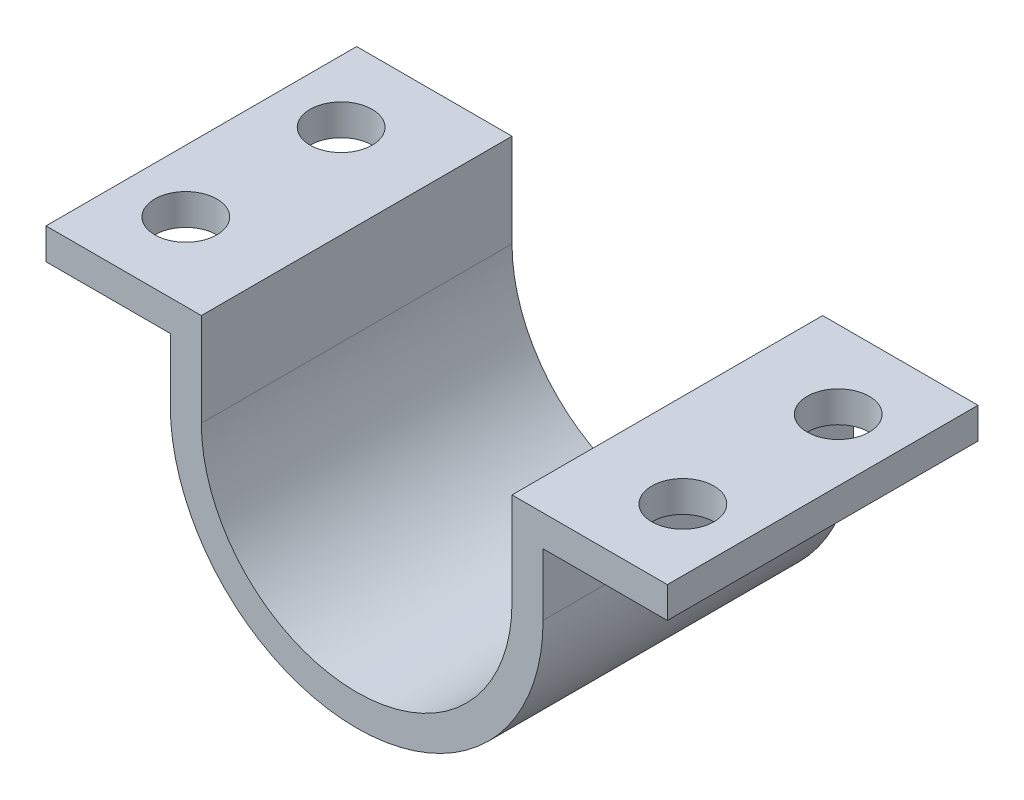
ISO-10303-21;
HEADER;
FILE_DESCRIPTION(('STEP AP214'),'2;1');
FILE_NAME('part.step','',(''),(''),'','','');
FILE_SCHEMA(('AUTOMOTIVE_DESIGN { 1 0 10303 214 1 1 1 1 }'));
ENDSEC;
DATA;
#1=APPLICATION_CONTEXT('core data for automotive mechanical design processes');
#2=APPLICATION_PROTOCOL_DEFINITION('international standard','automotive_design',2000,#1);
#3=PRODUCT_CONTEXT('',#1,'mechanical');
#4=PRODUCT('Part','Part','',(#3));
#5=PRODUCT_RELATED_PRODUCT_CATEGORY('part','',(#4));
#6=PRODUCT_DEFINITION_FORMATION('','',#4);
#7=PRODUCT_DEFINITION_CONTEXT('part definition',#1,'design');
#8=PRODUCT_DEFINITION('design','',#6,#7);
#9=PRODUCT_DEFINITION_SHAPE('','',#8);
#10=(LENGTH_UNIT() NAMED_UNIT(*) SI_UNIT(.MILLI.,.METRE.));
#11=(NAMED_UNIT(*) PLANE_ANGLE_UNIT() SI_UNIT($,.RADIAN.));
#12=(NAMED_UNIT(*) SI_UNIT($,.STERADIAN.) SOLID_ANGLE_UNIT());
#13=UNCERTAINTY_MEASURE_WITH_UNIT(LENGTH_MEASURE(1.E-05),#10,'distance_accuracy_value','');
#14=(GEOMETRIC_REPRESENTATION_CONTEXT(3) GLOBAL_UNCERTAINTY_ASSIGNED_CONTEXT((#13)) GLOBAL_UNIT_ASSIGNED_CONTEXT((#10,
#11,#12)) REPRESENTATION_CONTEXT('',''));
#15=CARTESIAN_POINT('',(0.,0.,0.));
#16=DIRECTION('',(0.,0.,1.));
#17=DIRECTION('',(1.,0.,0.));
#18=AXIS2_PLACEMENT_3D('',#15,#16,#17);
#19=CARTESIAN_POINT('',(-50.,15.,50.));
#20=DIRECTION('',(1.,0.,0.));
#21=DIRECTION('',(0.,0.,-1.));
#22=AXIS2_PLACEMENT_3D('',#19,#20,#21);
#23=PLANE('',#22);
#24=DIRECTION('',(0.,-1.,0.));
#25=VECTOR('',#24,1.);
#26=CARTESIAN_POINT('',(-50.,15.,0.));
#27=LINE('',#26,#25);
#28=CARTESIAN_POINT('',(-50.,15.,0.));
#29=VERTEX_POINT('',#28);
#30=CARTESIAN_POINT('',(-50.,10.,0.));
#31=VERTEX_POINT('',#30);
#32=EDGE_CURVE('E170',#29,#31,#27,.T.);
#33=ORIENTED_EDGE('',*,*,#32,.T.);
#34=DIRECTION('',(0.,0.,-1.));
#35=VECTOR('',#34,1.);
#36=CARTESIAN_POINT('',(-50.,10.,50.));
#37=LINE('',#36,#35);
#38=CARTESIAN_POINT('',(-50.,10.,50.));
#39=VERTEX_POINT('',#38);
#40=EDGE_CURVE('E11',#39,#31,#37,.T.);
#41=ORIENTED_EDGE('',*,*,#40,.F.);
#42=DIRECTION('',(0.,-1.,0.));
#43=VECTOR('',#42,1.);
#44=CARTESIAN_POINT('',(-50.,15.,50.));
#45=LINE('',#44,#43);
#46=CARTESIAN_POINT('',(-50.,15.,50.));
#47=VERTEX_POINT('',#46);
#48=EDGE_CURVE('E205',#47,#39,#45,.T.);
#49=ORIENTED_EDGE('',*,*,#48,.F.);
#50=DIRECTION('',(0.,0.,-1.));
#51=VECTOR('',#50,1.);
#52=CARTESIAN_POINT('',(-50.,15.,50.));
#53=LINE('',#52,#51);
#54=EDGE_CURVE('E166',#47,#29,#53,.T.);
#55=ORIENTED_EDGE('',*,*,#54,.T.);
#56=EDGE_LOOP('',(#33,#41,#49,#55));
#57=FACE_BOUND('',#56,.T.);
#58=ADVANCED_FACE('F45',(#57),#23,.F.);
#59=CARTESIAN_POINT('',(-50.,10.,50.));
#60=DIRECTION('',(0.,1.,0.));
#61=DIRECTION('',(0.,0.,1.));
#62=AXIS2_PLACEMENT_3D('',#59,#60,#61);
#63=PLANE('',#62);
#64=CARTESIAN_POINT('',(-40.,10.,37.5));
#65=DIRECTION('',(0.,-1.,0.));
#66=DIRECTION('',(0.,0.,1.));
#67=AXIS2_PLACEMENT_3D('',#64,#65,#66);
#68=CIRCLE('',#67,5.00000000000001);
#69=CARTESIAN_POINT('',(-40.,10.,42.5));
#70=VERTEX_POINT('',#69);
#71=EDGE_CURVE('E420',#70,#70,#68,.T.);
#72=ORIENTED_EDGE('',*,*,#71,.F.);
#73=EDGE_LOOP('',(#72));
#74=FACE_BOUND('',#73,.T.);
#75=CARTESIAN_POINT('',(-40.,10.,12.5));
#76=DIRECTION('',(0.,-1.,0.));
#77=DIRECTION('',(0.,0.,-1.));
#78=AXIS2_PLACEMENT_3D('',#75,#76,#77);
#79=CIRCLE('',#78,5.00000000000001);
#80=CARTESIAN_POINT('',(-40.,10.,7.49999999999999));
#81=VERTEX_POINT('',#80);
#82=EDGE_CURVE('E410',#81,#81,#79,.T.);
#83=ORIENTED_EDGE('',*,*,#82,.F.);
#84=EDGE_LOOP('',(#83));
#85=FACE_BOUND('',#84,.T.);
#86=DIRECTION('',(1.,0.,0.));
#87=VECTOR('',#86,1.);
#88=CARTESIAN_POINT('',(-50.,10.,0.));
#89=LINE('',#88,#87);
#90=CARTESIAN_POINT('',(-30.,10.,0.));
#91=VERTEX_POINT('',#90);
#92=EDGE_CURVE('E174',#31,#91,#89,.T.);
#93=ORIENTED_EDGE('',*,*,#92,.T.);
#94=DIRECTION('',(0.,0.,-1.));
#95=VECTOR('',#94,1.);
#96=CARTESIAN_POINT('',(-30.,10.,50.));
#97=LINE('',#96,#95);
#98=CARTESIAN_POINT('',(-30.,10.,50.));
#99=VERTEX_POINT('',#98);
#100=EDGE_CURVE('E54',#99,#91,#97,.T.);
#101=ORIENTED_EDGE('',*,*,#100,.F.);
#102=DIRECTION('',(1.,0.,0.));
#103=VECTOR('',#102,1.);
#104=CARTESIAN_POINT('',(-50.,10.,50.));
#105=LINE('',#104,#103);
#106=EDGE_CURVE('E117',#39,#99,#105,.T.);
#107=ORIENTED_EDGE('',*,*,#106,.F.);
#108=ORIENTED_EDGE('',*,*,#40,.T.);
#109=EDGE_LOOP('',(#93,#101,#107,#108));
#110=FACE_BOUND('',#109,.T.);
#111=ADVANCED_FACE('F304',(#74,#85,#110),#63,.F.);
#112=CARTESIAN_POINT('',(-30.,10.,50.));
#113=DIRECTION('',(1.,0.,0.));
#114=DIRECTION('',(0.,1.,0.));
#115=AXIS2_PLACEMENT_3D('',#112,#113,#114);
#116=PLANE('',#115);
#117=DIRECTION('',(0.,-1.,0.));
#118=VECTOR('',#117,1.);
#119=CARTESIAN_POINT('',(-30.,10.,0.));
#120=LINE('',#119,#118);
#121=CARTESIAN_POINT('',(-30.,0.,0.));
#122=VERTEX_POINT('',#121);
#123=EDGE_CURVE('E178',#91,#122,#120,.T.);
#124=ORIENTED_EDGE('',*,*,#123,.T.);
#125=DIRECTION('',(0.,0.,-1.));
#126=VECTOR('',#125,1.);
#127=CARTESIAN_POINT('',(-30.,0.,50.));
#128=LINE('',#127,#126);
#129=CARTESIAN_POINT('',(-30.,0.,50.));
#130=VERTEX_POINT('',#129);
#131=EDGE_CURVE('E232',#130,#122,#128,.T.);
#132=ORIENTED_EDGE('',*,*,#131,.F.);
#133=DIRECTION('',(0.,-1.,0.));
#134=VECTOR('',#133,1.);
#135=CARTESIAN_POINT('',(-30.,10.,50.));
#136=LINE('',#135,#134);
#137=EDGE_CURVE('E242',#99,#130,#136,.T.);
#138=ORIENTED_EDGE('',*,*,#137,.F.);
#139=ORIENTED_EDGE('',*,*,#100,.T.);
#140=EDGE_LOOP('',(#124,#132,#138,#139));
#141=FACE_BOUND('',#140,.T.);
#142=ADVANCED_FACE('F240',(#141),#116,.F.);
#143=CARTESIAN_POINT('',(0.,0.,50.));
#144=DIRECTION('',(0.,0.,-1.));
#145=DIRECTION('',(-1.,0.,0.));
#146=AXIS2_PLACEMENT_3D('',#143,#144,#145);
#147=CYLINDRICAL_SURFACE('',#146,30.);
#148=CARTESIAN_POINT('',(0.,0.,0.));
#149=DIRECTION('',(0.,0.,1.));
#150=DIRECTION('',(1.,0.,0.));
#151=AXIS2_PLACEMENT_3D('',#148,#149,#150);
#152=CIRCLE('',#151,30.);
#153=CARTESIAN_POINT('',(30.,0.,0.));
#154=VERTEX_POINT('',#153);
#155=EDGE_CURVE('E181',#122,#154,#152,.T.);
#156=ORIENTED_EDGE('',*,*,#155,.T.);
#157=DIRECTION('',(0.,0.,-1.));
#158=VECTOR('',#157,1.);
#159=CARTESIAN_POINT('',(30.,0.,50.));
#160=LINE('',#159,#158);
#161=CARTESIAN_POINT('',(30.,0.,50.));
#162=VERTEX_POINT('',#161);
#163=EDGE_CURVE('E228',#162,#154,#160,.T.);
#164=ORIENTED_EDGE('',*,*,#163,.F.);
#165=CARTESIAN_POINT('',(0.,0.,50.));
#166=DIRECTION('',(0.,0.,1.));
#167=DIRECTION('',(1.,0.,0.));
#168=AXIS2_PLACEMENT_3D('',#165,#166,#167);
#169=CIRCLE('',#168,30.);
#170=EDGE_CURVE('E261',#130,#162,#169,.T.);
#171=ORIENTED_EDGE('',*,*,#170,.F.);
#172=ORIENTED_EDGE('',*,*,#131,.T.);
#173=EDGE_LOOP('',(#156,#164,#171,#172));
#174=FACE_BOUND('',#173,.T.);
#175=ADVANCED_FACE('F251',(#174),#147,.T.);
#176=CARTESIAN_POINT('',(30.,0.,50.));
#177=DIRECTION('',(-1.,0.,0.));
#178=DIRECTION('',(0.,-1.,0.));
#179=AXIS2_PLACEMENT_3D('',#176,#177,#178);
#180=PLANE('',#179);
#181=DIRECTION('',(0.,1.,0.));
#182=VECTOR('',#181,1.);
#183=CARTESIAN_POINT('',(30.,0.,0.));
#184=LINE('',#183,#182);
#185=CARTESIAN_POINT('',(30.,10.,0.));
#186=VERTEX_POINT('',#185);
#187=EDGE_CURVE('E184',#154,#186,#184,.T.);
#188=ORIENTED_EDGE('',*,*,#187,.T.);
#189=DIRECTION('',(0.,0.,-1.));
#190=VECTOR('',#189,1.);
#191=CARTESIAN_POINT('',(30.,10.,50.));
#192=LINE('',#191,#190);
#193=CARTESIAN_POINT('',(30.,10.,50.));
#194=VERTEX_POINT('',#193);
#195=EDGE_CURVE('E224',#194,#186,#192,.T.);
#196=ORIENTED_EDGE('',*,*,#195,.F.);
#197=DIRECTION('',(0.,1.,0.));
#198=VECTOR('',#197,1.);
#199=CARTESIAN_POINT('',(30.,0.,50.));
#200=LINE('',#199,#198);
#201=EDGE_CURVE('E257',#162,#194,#200,.T.);
#202=ORIENTED_EDGE('',*,*,#201,.F.);
#203=ORIENTED_EDGE('',*,*,#163,.T.);
#204=EDGE_LOOP('',(#188,#196,#202,#203));
#205=FACE_BOUND('',#204,.T.);
#206=ADVANCED_FACE('F255',(#205),#180,.F.);
#207=CARTESIAN_POINT('',(30.,10.,50.));
#208=DIRECTION('',(0.,1.,0.));
#209=DIRECTION('',(0.,0.,1.));
#210=AXIS2_PLACEMENT_3D('',#207,#208,#209);
#211=PLANE('',#210);
#212=CARTESIAN_POINT('',(40.,10.,12.5));
#213=DIRECTION('',(0.,-1.,0.));
#214=DIRECTION('',(0.,0.,1.));
#215=AXIS2_PLACEMENT_3D('',#212,#213,#214);
#216=CIRCLE('',#215,5.00000000000001);
#217=CARTESIAN_POINT('',(40.,10.,17.5));
#218=VERTEX_POINT('',#217);
#219=EDGE_CURVE('E402',#218,#218,#216,.T.);
#220=ORIENTED_EDGE('',*,*,#219,.F.);
#221=EDGE_LOOP('',(#220));
#222=FACE_BOUND('',#221,.T.);
#223=CARTESIAN_POINT('',(40.,10.,37.5));
#224=DIRECTION('',(0.,-1.,0.));
#225=DIRECTION('',(0.,0.,-1.));
#226=AXIS2_PLACEMENT_3D('',#223,#224,#225);
#227=CIRCLE('',#226,5.00000000000001);
#228=CARTESIAN_POINT('',(40.,10.,32.5));
#229=VERTEX_POINT('',#228);
#230=EDGE_CURVE('E404',#229,#229,#227,.T.);
#231=ORIENTED_EDGE('',*,*,#230,.F.);
#232=EDGE_LOOP('',(#231));
#233=FACE_BOUND('',#232,.T.);
#234=DIRECTION('',(1.,0.,0.));
#235=VECTOR('',#234,1.);
#236=CARTESIAN_POINT('',(30.,10.,0.));
#237=LINE('',#236,#235);
#238=CARTESIAN_POINT('',(50.,10.,0.));
#239=VERTEX_POINT('',#238);
#240=EDGE_CURVE('E187',#186,#239,#237,.T.);
#241=ORIENTED_EDGE('',*,*,#240,.T.);
#242=DIRECTION('',(0.,0.,-1.));
#243=VECTOR('',#242,1.);
#244=CARTESIAN_POINT('',(50.,10.,50.));
#245=LINE('',#244,#243);
#246=CARTESIAN_POINT('',(50.,10.,50.));
#247=VERTEX_POINT('',#246);
#248=EDGE_CURVE('E220',#247,#239,#245,.T.);
#249=ORIENTED_EDGE('',*,*,#248,.F.);
#250=DIRECTION('',(1.,0.,0.));
#251=VECTOR('',#250,1.);
#252=CARTESIAN_POINT('',(30.,10.,50.));
#253=LINE('',#252,#251);
#254=EDGE_CURVE('E260',#194,#247,#253,.T.);
#255=ORIENTED_EDGE('',*,*,#254,.F.);
#256=ORIENTED_EDGE('',*,*,#195,.T.);
#257=EDGE_LOOP('',(#241,#249,#255,#256));
#258=FACE_BOUND('',#257,.T.);
#259=ADVANCED_FACE('F322',(#222,#233,#258),#211,.F.);
#260=CARTESIAN_POINT('',(50.,15.,50.));
#261=DIRECTION('',(-1.,0.,0.));
#262=DIRECTION('',(0.,0.,1.));
#263=AXIS2_PLACEMENT_3D('',#260,#261,#262);
#264=PLANE('',#263);
#265=DIRECTION('',(0.,1.,0.));
#266=VECTOR('',#265,1.);
#267=CARTESIAN_POINT('',(50.,15.,0.));
#268=LINE('',#267,#266);
#269=CARTESIAN_POINT('',(50.,15.,0.));
#270=VERTEX_POINT('',#269);
#271=EDGE_CURVE('E190',#239,#270,#268,.T.);
#272=ORIENTED_EDGE('',*,*,#271,.T.);
#273=DIRECTION('',(0.,0.,-1.));
#274=VECTOR('',#273,1.);
#275=CARTESIAN_POINT('',(50.,15.,50.));
#276=LINE('',#275,#274);
#277=CARTESIAN_POINT('',(50.,15.,50.));
#278=VERTEX_POINT('',#277);
#279=EDGE_CURVE('E216',#278,#270,#276,.T.);
#280=ORIENTED_EDGE('',*,*,#279,.F.);
#281=DIRECTION('',(0.,1.,0.));
#282=VECTOR('',#281,1.);
#283=CARTESIAN_POINT('',(50.,15.,50.));
#284=LINE('',#283,#282);
#285=EDGE_CURVE('E265',#247,#278,#284,.T.);
#286=ORIENTED_EDGE('',*,*,#285,.F.);
#287=ORIENTED_EDGE('',*,*,#248,.T.);
#288=EDGE_LOOP('',(#272,#280,#286,#287));
#289=FACE_BOUND('',#288,.T.);
#290=ADVANCED_FACE('F324',(#289),#264,.F.);
#291=CARTESIAN_POINT('',(25.,15.,50.));
#292=DIRECTION('',(0.,-1.,0.));
#293=DIRECTION('',(0.,0.,-1.));
#294=AXIS2_PLACEMENT_3D('',#291,#292,#293);
#295=PLANE('',#294);
#296=CARTESIAN_POINT('',(40.,15.,12.5));
#297=DIRECTION('',(0.,-1.,0.));
#298=DIRECTION('',(0.,0.,1.));
#299=AXIS2_PLACEMENT_3D('',#296,#297,#298);
#300=CIRCLE('',#299,5.00000000000001);
#301=CARTESIAN_POINT('',(40.,15.,17.5));
#302=VERTEX_POINT('',#301);
#303=EDGE_CURVE('E399',#302,#302,#300,.T.);
#304=ORIENTED_EDGE('',*,*,#303,.T.);
#305=EDGE_LOOP('',(#304));
#306=FACE_BOUND('',#305,.T.);
#307=CARTESIAN_POINT('',(40.,15.,37.5));
#308=DIRECTION('',(0.,-1.,0.));
#309=DIRECTION('',(0.,0.,-1.));
#310=AXIS2_PLACEMENT_3D('',#307,#308,#309);
#311=CIRCLE('',#310,5.00000000000001);
#312=CARTESIAN_POINT('',(40.,15.,32.5));
#313=VERTEX_POINT('',#312);
#314=EDGE_CURVE('E175',#313,#313,#311,.T.);
#315=ORIENTED_EDGE('',*,*,#314,.T.);
#316=EDGE_LOOP('',(#315));
#317=FACE_BOUND('',#316,.T.);
#318=DIRECTION('',(-1.,0.,0.));
#319=VECTOR('',#318,1.);
#320=CARTESIAN_POINT('',(25.,15.,0.));
#321=LINE('',#320,#319);
#322=CARTESIAN_POINT('',(25.,15.,0.));
#323=VERTEX_POINT('',#322);
#324=EDGE_CURVE('E193',#270,#323,#321,.T.);
#325=ORIENTED_EDGE('',*,*,#324,.T.);
#326=DIRECTION('',(0.,0.,-1.));
#327=VECTOR('',#326,1.);
#328=CARTESIAN_POINT('',(25.,15.,50.));
#329=LINE('',#328,#327);
#330=CARTESIAN_POINT('',(25.,15.,50.));
#331=VERTEX_POINT('',#330);
#332=EDGE_CURVE('E212',#331,#323,#329,.T.);
#333=ORIENTED_EDGE('',*,*,#332,.F.);
#334=DIRECTION('',(-1.,0.,0.));
#335=VECTOR('',#334,1.);
#336=CARTESIAN_POINT('',(25.,15.,50.));
#337=LINE('',#336,#335);
#338=EDGE_CURVE('E272',#278,#331,#337,.T.);
#339=ORIENTED_EDGE('',*,*,#338,.F.);
#340=ORIENTED_EDGE('',*,*,#279,.T.);
#341=EDGE_LOOP('',(#325,#333,#339,#340));
#342=FACE_BOUND('',#341,.T.);
#343=ADVANCED_FACE('F280',(#306,#317,#342),#295,.F.);
#344=CARTESIAN_POINT('',(25.,0.,50.));
#345=DIRECTION('',(1.,0.,0.));
#346=DIRECTION('',(0.,0.,-1.));
#347=AXIS2_PLACEMENT_3D('',#344,#345,#346);
#348=PLANE('',#347);
#349=DIRECTION('',(0.,-1.,0.));
#350=VECTOR('',#349,1.);
#351=CARTESIAN_POINT('',(25.,0.,0.));
#352=LINE('',#351,#350);
#353=CARTESIAN_POINT('',(25.,0.,0.));
#354=VERTEX_POINT('',#353);
#355=EDGE_CURVE('E196',#323,#354,#352,.T.);
#356=ORIENTED_EDGE('',*,*,#355,.T.);
#357=DIRECTION('',(0.,0.,-1.));
#358=VECTOR('',#357,1.);
#359=CARTESIAN_POINT('',(25.,0.,50.));
#360=LINE('',#359,#358);
#361=CARTESIAN_POINT('',(25.,0.,50.));
#362=VERTEX_POINT('',#361);
#363=EDGE_CURVE('E159',#362,#354,#360,.T.);
#364=ORIENTED_EDGE('',*,*,#363,.F.);
#365=DIRECTION('',(0.,-1.,0.));
#366=VECTOR('',#365,1.);
#367=CARTESIAN_POINT('',(25.,0.,50.));
#368=LINE('',#367,#366);
#369=EDGE_CURVE('E148',#331,#362,#368,.T.);
#370=ORIENTED_EDGE('',*,*,#369,.F.);
#371=ORIENTED_EDGE('',*,*,#332,.T.);
#372=EDGE_LOOP('',(#356,#364,#370,#371));
#373=FACE_BOUND('',#372,.T.);
#374=ADVANCED_FACE('F284',(#373),#348,.F.);
#375=CARTESIAN_POINT('',(0.,0.,50.));
#376=DIRECTION('',(0.,0.,-1.));
#377=DIRECTION('',(-1.,0.,0.));
#378=AXIS2_PLACEMENT_3D('',#375,#376,#377);
#379=CYLINDRICAL_SURFACE('',#378,25.);
#380=CARTESIAN_POINT('',(0.,0.,0.));
#381=DIRECTION('',(0.,0.,-1.));
#382=DIRECTION('',(1.,0.,0.));
#383=AXIS2_PLACEMENT_3D('',#380,#381,#382);
#384=CIRCLE('',#383,25.);
#385=CARTESIAN_POINT('',(-25.,0.,0.));
#386=VERTEX_POINT('',#385);
#387=EDGE_CURVE('E157',#354,#386,#384,.T.);
#388=ORIENTED_EDGE('',*,*,#387,.T.);
#389=DIRECTION('',(0.,0.,-1.));
#390=VECTOR('',#389,1.);
#391=CARTESIAN_POINT('',(-25.,0.,50.));
#392=LINE('',#391,#390);
#393=CARTESIAN_POINT('',(-25.,0.,50.));
#394=VERTEX_POINT('',#393);
#395=EDGE_CURVE('E154',#394,#386,#392,.T.);
#396=ORIENTED_EDGE('',*,*,#395,.F.);
#397=CARTESIAN_POINT('',(0.,0.,50.));
#398=DIRECTION('',(0.,0.,-1.));
#399=DIRECTION('',(1.,0.,0.));
#400=AXIS2_PLACEMENT_3D('',#397,#398,#399);
#401=CIRCLE('',#400,25.);
#402=EDGE_CURVE('E142',#362,#394,#401,.T.);
#403=ORIENTED_EDGE('',*,*,#402,.F.);
#404=ORIENTED_EDGE('',*,*,#363,.T.);
#405=EDGE_LOOP('',(#388,#396,#403,#404));
#406=FACE_BOUND('',#405,.T.);
#407=ADVANCED_FACE('F155',(#406),#379,.F.);
#408=CARTESIAN_POINT('',(-25.,15.,50.));
#409=DIRECTION('',(-1.,0.,0.));
#410=DIRECTION('',(0.,-1.,0.));
#411=AXIS2_PLACEMENT_3D('',#408,#409,#410);
#412=PLANE('',#411);
#413=DIRECTION('',(0.,1.,0.));
#414=VECTOR('',#413,1.);
#415=CARTESIAN_POINT('',(-25.,15.,0.));
#416=LINE('',#415,#414);
#417=CARTESIAN_POINT('',(-25.,15.,0.));
#418=VERTEX_POINT('',#417);
#419=EDGE_CURVE('E103',#386,#418,#416,.T.);
#420=ORIENTED_EDGE('',*,*,#419,.T.);
#421=DIRECTION('',(0.,0.,-1.));
#422=VECTOR('',#421,1.);
#423=CARTESIAN_POINT('',(-25.,15.,50.));
#424=LINE('',#423,#422);
#425=CARTESIAN_POINT('',(-25.,15.,50.));
#426=VERTEX_POINT('',#425);
#427=EDGE_CURVE('E160',#426,#418,#424,.T.);
#428=ORIENTED_EDGE('',*,*,#427,.F.);
#429=DIRECTION('',(0.,1.,0.));
#430=VECTOR('',#429,1.);
#431=CARTESIAN_POINT('',(-25.,15.,50.));
#432=LINE('',#431,#430);
#433=EDGE_CURVE('E146',#394,#426,#432,.T.);
#434=ORIENTED_EDGE('',*,*,#433,.F.);
#435=ORIENTED_EDGE('',*,*,#395,.T.);
#436=EDGE_LOOP('',(#420,#428,#434,#435));
#437=FACE_BOUND('',#436,.T.);
#438=ADVANCED_FACE('F162',(#437),#412,.F.);
#439=CARTESIAN_POINT('',(-50.,15.,50.));
#440=DIRECTION('',(0.,-1.,0.));
#441=DIRECTION('',(1.,0.,0.));
#442=AXIS2_PLACEMENT_3D('',#439,#440,#441);
#443=PLANE('',#442);
#444=CARTESIAN_POINT('',(-40.,15.,37.5));
#445=DIRECTION('',(0.,-1.,0.));
#446=DIRECTION('',(0.,0.,1.));
#447=AXIS2_PLACEMENT_3D('',#444,#445,#446);
#448=CIRCLE('',#447,5.00000000000001);
#449=CARTESIAN_POINT('',(-40.,15.,42.5));
#450=VERTEX_POINT('',#449);
#451=EDGE_CURVE('E424',#450,#450,#448,.T.);
#452=ORIENTED_EDGE('',*,*,#451,.T.);
#453=EDGE_LOOP('',(#452));
#454=FACE_BOUND('',#453,.T.);
#455=CARTESIAN_POINT('',(-40.,15.,12.5));
#456=DIRECTION('',(0.,-1.,0.));
#457=DIRECTION('',(0.,0.,-1.));
#458=AXIS2_PLACEMENT_3D('',#455,#456,#457);
#459=CIRCLE('',#458,5.00000000000001);
#460=CARTESIAN_POINT('',(-40.,15.,7.49999999999999));
#461=VERTEX_POINT('',#460);
#462=EDGE_CURVE('E416',#461,#461,#459,.T.);
#463=ORIENTED_EDGE('',*,*,#462,.T.);
#464=EDGE_LOOP('',(#463));
#465=FACE_BOUND('',#464,.T.);
#466=DIRECTION('',(-1.,0.,0.));
#467=VECTOR('',#466,1.);
#468=CARTESIAN_POINT('',(-50.,15.,0.));
#469=LINE('',#468,#467);
#470=EDGE_CURVE('E109',#418,#29,#469,.T.);
#471=ORIENTED_EDGE('',*,*,#470,.T.);
#472=ORIENTED_EDGE('',*,*,#54,.F.);
#473=DIRECTION('',(-1.,0.,0.));
#474=VECTOR('',#473,1.);
#475=CARTESIAN_POINT('',(-50.,15.,50.));
#476=LINE('',#475,#474);
#477=EDGE_CURVE('E62',#426,#47,#476,.T.);
#478=ORIENTED_EDGE('',*,*,#477,.F.);
#479=ORIENTED_EDGE('',*,*,#427,.T.);
#480=EDGE_LOOP('',(#471,#472,#478,#479));
#481=FACE_BOUND('',#480,.T.);
#482=ADVANCED_FACE('F288',(#454,#465,#481),#443,.F.);
#483=CARTESIAN_POINT('',(0.,0.,50.));
#484=DIRECTION('',(0.,0.,1.));
#485=DIRECTION('',(1.,0.,0.));
#486=AXIS2_PLACEMENT_3D('',#483,#484,#485);
#487=PLANE('',#486);
#488=ORIENTED_EDGE('',*,*,#48,.T.);
#489=ORIENTED_EDGE('',*,*,#106,.T.);
#490=ORIENTED_EDGE('',*,*,#137,.T.);
#491=ORIENTED_EDGE('',*,*,#170,.T.);
#492=ORIENTED_EDGE('',*,*,#201,.T.);
#493=ORIENTED_EDGE('',*,*,#254,.T.);
#494=ORIENTED_EDGE('',*,*,#285,.T.);
#495=ORIENTED_EDGE('',*,*,#338,.T.);
#496=ORIENTED_EDGE('',*,*,#369,.T.);
#497=ORIENTED_EDGE('',*,*,#402,.T.);
#498=ORIENTED_EDGE('',*,*,#433,.T.);
#499=ORIENTED_EDGE('',*,*,#477,.T.);
#500=EDGE_LOOP('',(#488,#489,#490,#491,#492,#493,#494,#495,#496,#497,#498,#499));
#501=FACE_BOUND('',#500,.T.);
#502=ADVANCED_FACE('F144',(#501),#487,.T.);
#503=CARTESIAN_POINT('',(0.,0.,0.));
#504=DIRECTION('',(0.,0.,1.));
#505=DIRECTION('',(1.,0.,0.));
#506=AXIS2_PLACEMENT_3D('',#503,#504,#505);
#507=PLANE('',#506);
#508=ORIENTED_EDGE('',*,*,#32,.F.);
#509=ORIENTED_EDGE('',*,*,#470,.F.);
#510=ORIENTED_EDGE('',*,*,#419,.F.);
#511=ORIENTED_EDGE('',*,*,#387,.F.);
#512=ORIENTED_EDGE('',*,*,#355,.F.);
#513=ORIENTED_EDGE('',*,*,#324,.F.);
#514=ORIENTED_EDGE('',*,*,#271,.F.);
#515=ORIENTED_EDGE('',*,*,#240,.F.);
#516=ORIENTED_EDGE('',*,*,#187,.F.);
#517=ORIENTED_EDGE('',*,*,#155,.F.);
#518=ORIENTED_EDGE('',*,*,#123,.F.);
#519=ORIENTED_EDGE('',*,*,#92,.F.);
#520=EDGE_LOOP('',(#508,#509,#510,#511,#512,#513,#514,#515,#516,#517,#518,#519));
#521=FACE_BOUND('',#520,.T.);
#522=ADVANCED_FACE('F246',(#521),#507,.F.);
#523=CARTESIAN_POINT('',(-40.,15.,12.5));
#524=DIRECTION('',(0.,-1.,0.));
#525=DIRECTION('',(0.,0.,-1.));
#526=AXIS2_PLACEMENT_3D('',#523,#524,#525);
#527=CYLINDRICAL_SURFACE('',#526,5.00000000000001);
#528=ORIENTED_EDGE('',*,*,#462,.F.);
#529=EDGE_LOOP('',(#528));
#530=FACE_BOUND('',#529,.T.);
#531=ORIENTED_EDGE('',*,*,#82,.T.);
#532=EDGE_LOOP('',(#531));
#533=FACE_BOUND('',#532,.T.);
#534=ADVANCED_FACE('F353',(#530,#533),#527,.F.);
#535=CARTESIAN_POINT('',(-40.,15.,37.5));
#536=DIRECTION('',(0.,-1.,0.));
#537=DIRECTION('',(0.,0.,-1.));
#538=AXIS2_PLACEMENT_3D('',#535,#536,#537);
#539=CYLINDRICAL_SURFACE('',#538,5.00000000000001);
#540=ORIENTED_EDGE('',*,*,#451,.F.);
#541=EDGE_LOOP('',(#540));
#542=FACE_BOUND('',#541,.T.);
#543=ORIENTED_EDGE('',*,*,#71,.T.);
#544=EDGE_LOOP('',(#543));
#545=FACE_BOUND('',#544,.T.);
#546=ADVANCED_FACE('F363',(#542,#545),#539,.F.);
#547=CARTESIAN_POINT('',(40.,15.,37.5));
#548=DIRECTION('',(0.,-1.,0.));
#549=DIRECTION('',(0.,0.,-1.));
#550=AXIS2_PLACEMENT_3D('',#547,#548,#549);
#551=CYLINDRICAL_SURFACE('',#550,5.00000000000001);
#552=ORIENTED_EDGE('',*,*,#314,.F.);
#553=EDGE_LOOP('',(#552));
#554=FACE_BOUND('',#553,.T.);
#555=ORIENTED_EDGE('',*,*,#230,.T.);
#556=EDGE_LOOP('',(#555));
#557=FACE_BOUND('',#556,.T.);
#558=ADVANCED_FACE('F373',(#554,#557),#551,.F.);
#559=CARTESIAN_POINT('',(40.,15.,12.5));
#560=DIRECTION('',(0.,-1.,0.));
#561=DIRECTION('',(0.,0.,-1.));
#562=AXIS2_PLACEMENT_3D('',#559,#560,#561);
#563=CYLINDRICAL_SURFACE('',#562,5.00000000000001);
#564=ORIENTED_EDGE('',*,*,#303,.F.);
#565=EDGE_LOOP('',(#564));
#566=FACE_BOUND('',#565,.T.);
#567=ORIENTED_EDGE('',*,*,#219,.T.);
#568=EDGE_LOOP('',(#567));
#569=FACE_BOUND('',#568,.T.);
#570=ADVANCED_FACE('F383',(#566,#569),#563,.F.);
#571=CLOSED_SHELL('',(#58,#111,#142,#175,#206,#259,#290,#343,#374,#407,#438,#482,#502,#522,#534,
#546,#558,#570));
#572=MANIFOLD_SOLID_BREP('B2',#571);
#573=ADVANCED_BREP_SHAPE_REPRESENTATION('',(#18,#572),#14);
#574=SHAPE_DEFINITION_REPRESENTATION(#9,#573);
ENDSEC;
END-ISO-10303-21;
